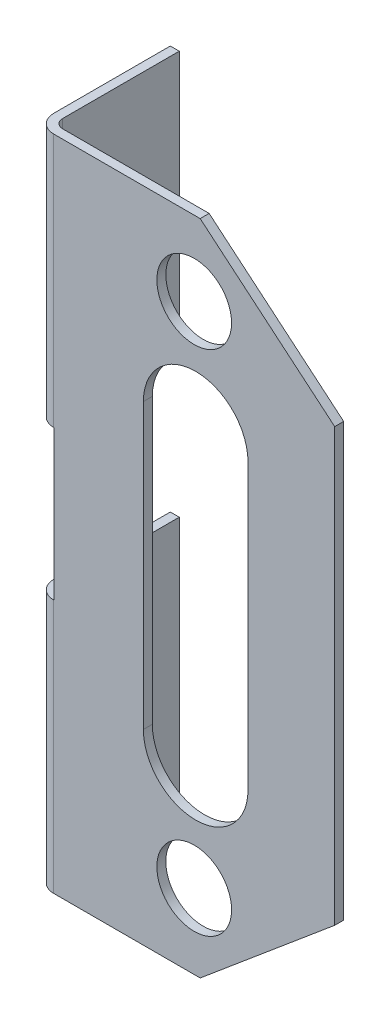
ISO-10303-21;
HEADER;
FILE_DESCRIPTION(('STEP AP214'),'2;1');
FILE_NAME('part.step','',(''),(''),'','','');
FILE_SCHEMA(('AUTOMOTIVE_DESIGN { 1 0 10303 214 1 1 1 1 }'));
ENDSEC;
DATA;
#1=APPLICATION_CONTEXT('core data for automotive mechanical design processes');
#2=APPLICATION_PROTOCOL_DEFINITION('international standard','automotive_design',2000,#1);
#3=PRODUCT_CONTEXT('',#1,'mechanical');
#4=PRODUCT('Part','Part','',(#3));
#5=PRODUCT_RELATED_PRODUCT_CATEGORY('part','',(#4));
#6=PRODUCT_DEFINITION_FORMATION('','',#4);
#7=PRODUCT_DEFINITION_CONTEXT('part definition',#1,'design');
#8=PRODUCT_DEFINITION('design','',#6,#7);
#9=PRODUCT_DEFINITION_SHAPE('','',#8);
#10=(LENGTH_UNIT() NAMED_UNIT(*) SI_UNIT(.MILLI.,.METRE.));
#11=(NAMED_UNIT(*) PLANE_ANGLE_UNIT() SI_UNIT($,.RADIAN.));
#12=(NAMED_UNIT(*) SI_UNIT($,.STERADIAN.) SOLID_ANGLE_UNIT());
#13=UNCERTAINTY_MEASURE_WITH_UNIT(LENGTH_MEASURE(1.E-05),#10,'distance_accuracy_value','');
#14=(GEOMETRIC_REPRESENTATION_CONTEXT(3) GLOBAL_UNCERTAINTY_ASSIGNED_CONTEXT((#13)) GLOBAL_UNIT_ASSIGNED_CONTEXT((#10,
#11,#12)) REPRESENTATION_CONTEXT('',''));
#15=CARTESIAN_POINT('',(0.,0.,0.));
#16=DIRECTION('',(0.,0.,1.));
#17=DIRECTION('',(1.,0.,0.));
#18=AXIS2_PLACEMENT_3D('',#15,#16,#17);
#19=CARTESIAN_POINT('',(-17.1278685868031,-12.6536882964313,-4.2));
#20=DIRECTION('',(0.,0.,-1.));
#21=DIRECTION('',(-1.,0.,0.));
#22=AXIS2_PLACEMENT_3D('',#19,#20,#21);
#23=PLANE('',#22);
#24=DIRECTION('',(0.,1.,0.));
#25=VECTOR('',#24,1.);
#26=CARTESIAN_POINT('',(-17.1278685868031,-8.4036882964313,-4.2));
#27=LINE('',#26,#25);
#28=CARTESIAN_POINT('',(-17.1278685868031,-12.6536882964313,-4.2));
#29=VERTEX_POINT('',#28);
#30=CARTESIAN_POINT('',(-17.1278685868031,-4.1536882964313,-4.2));
#31=VERTEX_POINT('',#30);
#32=EDGE_CURVE('E156',#29,#31,#27,.T.);
#33=ORIENTED_EDGE('',*,*,#32,.F.);
#34=DIRECTION('',(-1.,0.,0.));
#35=VECTOR('',#34,1.);
#36=CARTESIAN_POINT('',(-17.1278685868031,-12.6536882964313,-4.2));
#37=LINE('',#36,#35);
#38=CARTESIAN_POINT('',(-17.4278685868031,-12.6536882964313,-4.2));
#39=VERTEX_POINT('',#38);
#40=EDGE_CURVE('E212',#29,#39,#37,.T.);
#41=ORIENTED_EDGE('',*,*,#40,.T.);
#42=DIRECTION('',(0.,1.,0.));
#43=VECTOR('',#42,1.);
#44=CARTESIAN_POINT('',(-17.4278685868031,-8.4036882964313,-4.2));
#45=LINE('',#44,#43);
#46=CARTESIAN_POINT('',(-17.4278685868031,-4.1536882964313,-4.2));
#47=VERTEX_POINT('',#46);
#48=EDGE_CURVE('E138',#39,#47,#45,.T.);
#49=ORIENTED_EDGE('',*,*,#48,.T.);
#50=DIRECTION('',(1.,0.,0.));
#51=VECTOR('',#50,1.);
#52=CARTESIAN_POINT('',(-17.1278685868031,-4.1536882964313,-4.2));
#53=LINE('',#52,#51);
#54=EDGE_CURVE('E128',#31,#47,#53,.F.);
#55=ORIENTED_EDGE('',*,*,#54,.F.);
#56=EDGE_LOOP('',(#33,#41,#49,#55));
#57=FACE_BOUND('',#56,.T.);
#58=ADVANCED_FACE('F16',(#57),#23,.T.);
#59=CARTESIAN_POINT('',(-17.1278685868031,-4.1536882964313,-4.2));
#60=DIRECTION('',(0.,1.,0.));
#61=DIRECTION('',(0.,0.,1.));
#62=AXIS2_PLACEMENT_3D('',#59,#60,#61);
#63=PLANE('',#62);
#64=DIRECTION('',(1.,0.,0.));
#65=VECTOR('',#64,1.);
#66=CARTESIAN_POINT('',(-17.1278685868031,-4.1536882964313,0.));
#67=LINE('',#66,#65);
#68=CARTESIAN_POINT('',(-16.8178685868031,-4.1536882964313,0.));
#69=VERTEX_POINT('',#68);
#70=CARTESIAN_POINT('',(-16.8278685868031,-4.1536882964313,0.));
#71=VERTEX_POINT('',#70);
#72=EDGE_CURVE('E190',#69,#71,#67,.F.);
#73=ORIENTED_EDGE('',*,*,#72,.T.);
#74=CARTESIAN_POINT('',(-16.8278685868031,-4.1536882964313,-0.3));
#75=DIRECTION('',(0.,-1.,0.));
#76=DIRECTION('',(1.,0.,0.));
#77=AXIS2_PLACEMENT_3D('',#74,#75,#76);
#78=CIRCLE('',#77,0.3);
#79=CARTESIAN_POINT('',(-17.1278685868031,-4.1536882964313,-0.3));
#80=VERTEX_POINT('',#79);
#81=EDGE_CURVE('E273',#80,#71,#78,.F.);
#82=ORIENTED_EDGE('',*,*,#81,.F.);
#83=DIRECTION('',(0.,0.,-1.));
#84=VECTOR('',#83,1.);
#85=CARTESIAN_POINT('',(-17.1278685868031,-4.1536882964313,-1.95));
#86=LINE('',#85,#84);
#87=EDGE_CURVE('E159',#31,#80,#86,.F.);
#88=ORIENTED_EDGE('',*,*,#87,.F.);
#89=ORIENTED_EDGE('',*,*,#54,.T.);
#90=DIRECTION('',(0.,0.,-1.));
#91=VECTOR('',#90,1.);
#92=CARTESIAN_POINT('',(-17.4278685868031,-4.1536882964313,-1.95));
#93=LINE('',#92,#91);
#94=CARTESIAN_POINT('',(-17.4278685868031,-4.1536882964313,-0.3));
#95=VERTEX_POINT('',#94);
#96=EDGE_CURVE('E131',#47,#95,#93,.F.);
#97=ORIENTED_EDGE('',*,*,#96,.T.);
#98=CARTESIAN_POINT('',(-16.8278685868031,-4.1536882964313,-0.3));
#99=DIRECTION('',(0.,-1.,0.));
#100=DIRECTION('',(1.,0.,0.));
#101=AXIS2_PLACEMENT_3D('',#98,#99,#100);
#102=CIRCLE('',#101,0.6);
#103=CARTESIAN_POINT('',(-16.8278685868031,-4.1536882964313,0.3));
#104=VERTEX_POINT('',#103);
#105=EDGE_CURVE('E19',#95,#104,#102,.F.);
#106=ORIENTED_EDGE('',*,*,#105,.T.);
#107=DIRECTION('',(1.,0.,0.));
#108=VECTOR('',#107,1.);
#109=CARTESIAN_POINT('',(-17.1278685868031,-4.1536882964313,0.3));
#110=LINE('',#109,#108);
#111=CARTESIAN_POINT('',(-16.8178685868031,-4.1536882964313,0.3));
#112=VERTEX_POINT('',#111);
#113=EDGE_CURVE('E127',#104,#112,#110,.T.);
#114=ORIENTED_EDGE('',*,*,#113,.T.);
#115=DIRECTION('',(0.,0.,1.));
#116=VECTOR('',#115,1.);
#117=CARTESIAN_POINT('',(-16.8178685868031,-4.1536882964313,-4.2));
#118=LINE('',#117,#116);
#119=EDGE_CURVE('E201',#112,#69,#118,.F.);
#120=ORIENTED_EDGE('',*,*,#119,.T.);
#121=EDGE_LOOP('',(#73,#82,#88,#89,#97,#106,#114,#120));
#122=FACE_BOUND('',#121,.T.);
#123=ADVANCED_FACE('F132',(#122),#63,.T.);
#124=CARTESIAN_POINT('',(-17.1278685868031,0.846311703568698,0.3));
#125=DIRECTION('',(0.,-1.,0.));
#126=DIRECTION('',(1.,0.,0.));
#127=AXIS2_PLACEMENT_3D('',#124,#125,#126);
#128=PLANE('',#127);
#129=DIRECTION('',(1.,0.,0.));
#130=VECTOR('',#129,1.);
#131=CARTESIAN_POINT('',(-17.1278685868031,0.846311703568698,0.3));
#132=LINE('',#131,#130);
#133=CARTESIAN_POINT('',(-16.8178685868031,0.846311703568698,0.3));
#134=VERTEX_POINT('',#133);
#135=CARTESIAN_POINT('',(-16.8278685868031,0.846311703568698,0.3));
#136=VERTEX_POINT('',#135);
#137=EDGE_CURVE('E181',#134,#136,#132,.F.);
#138=ORIENTED_EDGE('',*,*,#137,.T.);
#139=CARTESIAN_POINT('',(-16.8278685868031,0.846311703568698,-0.3));
#140=DIRECTION('',(0.,-1.,0.));
#141=DIRECTION('',(1.,0.,0.));
#142=AXIS2_PLACEMENT_3D('',#139,#140,#141);
#143=CIRCLE('',#142,0.6);
#144=CARTESIAN_POINT('',(-17.4278685868031,0.846311703568698,-0.3));
#145=VERTEX_POINT('',#144);
#146=EDGE_CURVE('E173',#136,#145,#143,.T.);
#147=ORIENTED_EDGE('',*,*,#146,.T.);
#148=DIRECTION('',(0.,0.,-1.));
#149=VECTOR('',#148,1.);
#150=CARTESIAN_POINT('',(-17.4278685868031,0.846311703568698,-1.95));
#151=LINE('',#150,#149);
#152=CARTESIAN_POINT('',(-17.4278685868031,0.846311703568698,-4.2));
#153=VERTEX_POINT('',#152);
#154=EDGE_CURVE('E283',#145,#153,#151,.T.);
#155=ORIENTED_EDGE('',*,*,#154,.T.);
#156=DIRECTION('',(-1.,0.,0.));
#157=VECTOR('',#156,1.);
#158=CARTESIAN_POINT('',(-17.1278685868031,0.846311703568697,-4.2));
#159=LINE('',#158,#157);
#160=CARTESIAN_POINT('',(-17.1278685868031,0.846311703568698,-4.2));
#161=VERTEX_POINT('',#160);
#162=EDGE_CURVE('E172',#161,#153,#159,.T.);
#163=ORIENTED_EDGE('',*,*,#162,.F.);
#164=DIRECTION('',(0.,0.,-1.));
#165=VECTOR('',#164,1.);
#166=CARTESIAN_POINT('',(-17.1278685868031,0.846311703568698,-1.95));
#167=LINE('',#166,#165);
#168=CARTESIAN_POINT('',(-17.1278685868031,0.846311703568698,-0.3));
#169=VERTEX_POINT('',#168);
#170=EDGE_CURVE('E193',#169,#161,#167,.T.);
#171=ORIENTED_EDGE('',*,*,#170,.F.);
#172=CARTESIAN_POINT('',(-16.8278685868031,0.846311703568699,-0.3));
#173=DIRECTION('',(0.,-1.,0.));
#174=DIRECTION('',(1.,0.,0.));
#175=AXIS2_PLACEMENT_3D('',#172,#173,#174);
#176=CIRCLE('',#175,0.3);
#177=CARTESIAN_POINT('',(-16.8278685868031,0.846311703568698,0.));
#178=VERTEX_POINT('',#177);
#179=EDGE_CURVE('E276',#178,#169,#176,.T.);
#180=ORIENTED_EDGE('',*,*,#179,.F.);
#181=DIRECTION('',(1.,0.,0.));
#182=VECTOR('',#181,1.);
#183=CARTESIAN_POINT('',(-17.1278685868031,0.846311703568698,0.));
#184=LINE('',#183,#182);
#185=CARTESIAN_POINT('',(-16.8178685868031,0.846311703568698,0.));
#186=VERTEX_POINT('',#185);
#187=EDGE_CURVE('E187',#178,#186,#184,.T.);
#188=ORIENTED_EDGE('',*,*,#187,.T.);
#189=DIRECTION('',(0.,0.,1.));
#190=VECTOR('',#189,1.);
#191=CARTESIAN_POINT('',(-16.8178685868031,0.846311703568698,0.3));
#192=LINE('',#191,#190);
#193=EDGE_CURVE('E184',#186,#134,#192,.T.);
#194=ORIENTED_EDGE('',*,*,#193,.T.);
#195=EDGE_LOOP('',(#138,#147,#155,#163,#171,#180,#188,#194));
#196=FACE_BOUND('',#195,.T.);
#197=ADVANCED_FACE('F281',(#196),#128,.T.);
#198=CARTESIAN_POINT('',(-17.1278685868031,0.846311703568697,-4.2));
#199=DIRECTION('',(0.,0.,-1.));
#200=DIRECTION('',(-1.,0.,0.));
#201=AXIS2_PLACEMENT_3D('',#198,#199,#200);
#202=PLANE('',#201);
#203=DIRECTION('',(0.,1.,0.));
#204=VECTOR('',#203,1.);
#205=CARTESIAN_POINT('',(-17.1278685868031,5.0963117035687,-4.2));
#206=LINE('',#205,#204);
#207=CARTESIAN_POINT('',(-17.1278685868031,9.3463117035687,-4.2));
#208=VERTEX_POINT('',#207);
#209=EDGE_CURVE('E196',#161,#208,#206,.T.);
#210=ORIENTED_EDGE('',*,*,#209,.F.);
#211=ORIENTED_EDGE('',*,*,#162,.T.);
#212=DIRECTION('',(0.,1.,0.));
#213=VECTOR('',#212,1.);
#214=CARTESIAN_POINT('',(-17.4278685868031,5.0963117035687,-4.2));
#215=LINE('',#214,#213);
#216=CARTESIAN_POINT('',(-17.4278685868031,9.3463117035687,-4.2));
#217=VERTEX_POINT('',#216);
#218=EDGE_CURVE('E295',#153,#217,#215,.T.);
#219=ORIENTED_EDGE('',*,*,#218,.T.);
#220=DIRECTION('',(-1.,0.,0.));
#221=VECTOR('',#220,1.);
#222=CARTESIAN_POINT('',(-17.1278685868031,9.3463117035687,-4.2));
#223=LINE('',#222,#221);
#224=EDGE_CURVE('E169',#217,#208,#223,.F.);
#225=ORIENTED_EDGE('',*,*,#224,.T.);
#226=EDGE_LOOP('',(#210,#211,#219,#225));
#227=FACE_BOUND('',#226,.T.);
#228=ADVANCED_FACE('F489',(#227),#202,.T.);
#229=CARTESIAN_POINT('',(-16.8278685868031,9.3463117035687,-0.3));
#230=DIRECTION('',(0.,-1.,0.));
#231=DIRECTION('',(1.,0.,0.));
#232=AXIS2_PLACEMENT_3D('',#229,#230,#231);
#233=CYLINDRICAL_SURFACE('',#232,0.3);
#234=DIRECTION('',(0.,1.,0.));
#235=VECTOR('',#234,1.);
#236=CARTESIAN_POINT('',(-16.8278685868031,-1.6536882964313,0.));
#237=LINE('',#236,#235);
#238=CARTESIAN_POINT('',(-16.8278685868031,9.3463117035687,0.));
#239=VERTEX_POINT('',#238);
#240=EDGE_CURVE('E148',#239,#178,#237,.F.);
#241=ORIENTED_EDGE('',*,*,#240,.T.);
#242=ORIENTED_EDGE('',*,*,#179,.T.);
#243=DIRECTION('',(0.,1.,0.));
#244=VECTOR('',#243,1.);
#245=CARTESIAN_POINT('',(-17.1278685868031,5.0963117035687,-0.3));
#246=LINE('',#245,#244);
#247=CARTESIAN_POINT('',(-17.1278685868031,9.3463117035687,-0.3));
#248=VERTEX_POINT('',#247);
#249=EDGE_CURVE('E197',#248,#169,#246,.F.);
#250=ORIENTED_EDGE('',*,*,#249,.F.);
#251=CARTESIAN_POINT('',(-16.8278685868031,9.3463117035687,-0.3));
#252=DIRECTION('',(0.,-1.,0.));
#253=DIRECTION('',(1.,0.,0.));
#254=AXIS2_PLACEMENT_3D('',#251,#252,#253);
#255=CIRCLE('',#254,0.3);
#256=EDGE_CURVE('E178',#248,#239,#255,.F.);
#257=ORIENTED_EDGE('',*,*,#256,.T.);
#258=EDGE_LOOP('',(#241,#242,#250,#257));
#259=FACE_BOUND('',#258,.T.);
#260=ADVANCED_FACE('F483',(#259),#233,.F.);
#261=CARTESIAN_POINT('',(-16.8278685868031,-4.1536882964313,-0.3));
#262=DIRECTION('',(0.,-1.,0.));
#263=DIRECTION('',(1.,0.,0.));
#264=AXIS2_PLACEMENT_3D('',#261,#262,#263);
#265=CYLINDRICAL_SURFACE('',#264,0.3);
#266=DIRECTION('',(0.,1.,0.));
#267=VECTOR('',#266,1.);
#268=CARTESIAN_POINT('',(-16.8278685868031,-1.6536882964313,0.));
#269=LINE('',#268,#267);
#270=CARTESIAN_POINT('',(-16.8278685868031,-12.6536882964313,0.));
#271=VERTEX_POINT('',#270);
#272=EDGE_CURVE('E143',#71,#271,#269,.F.);
#273=ORIENTED_EDGE('',*,*,#272,.T.);
#274=CARTESIAN_POINT('',(-16.8278685868031,-12.6536882964313,-0.3));
#275=DIRECTION('',(0.,-1.,0.));
#276=DIRECTION('',(1.,0.,0.));
#277=AXIS2_PLACEMENT_3D('',#274,#275,#276);
#278=CIRCLE('',#277,0.3);
#279=CARTESIAN_POINT('',(-17.1278685868031,-12.6536882964313,-0.3));
#280=VERTEX_POINT('',#279);
#281=EDGE_CURVE('E164',#271,#280,#278,.T.);
#282=ORIENTED_EDGE('',*,*,#281,.T.);
#283=DIRECTION('',(0.,1.,0.));
#284=VECTOR('',#283,1.);
#285=CARTESIAN_POINT('',(-17.1278685868031,-8.4036882964313,-0.3));
#286=LINE('',#285,#284);
#287=EDGE_CURVE('E137',#80,#280,#286,.F.);
#288=ORIENTED_EDGE('',*,*,#287,.F.);
#289=ORIENTED_EDGE('',*,*,#81,.T.);
#290=EDGE_LOOP('',(#273,#282,#288,#289));
#291=FACE_BOUND('',#290,.T.);
#292=ADVANCED_FACE('F451',(#291),#265,.F.);
#293=CARTESIAN_POINT('',(-17.4278685868031,-8.4036882964313,-1.95));
#294=DIRECTION('',(1.,0.,0.));
#295=DIRECTION('',(0.,0.,-1.));
#296=AXIS2_PLACEMENT_3D('',#293,#294,#295);
#297=PLANE('',#296);
#298=ORIENTED_EDGE('',*,*,#96,.F.);
#299=ORIENTED_EDGE('',*,*,#48,.F.);
#300=DIRECTION('',(0.,0.,-1.));
#301=VECTOR('',#300,1.);
#302=CARTESIAN_POINT('',(-17.4278685868031,-12.6536882964313,0.3));
#303=LINE('',#302,#301);
#304=CARTESIAN_POINT('',(-17.4278685868031,-12.6536882964313,-0.3));
#305=VERTEX_POINT('',#304);
#306=EDGE_CURVE('E142',#305,#39,#303,.T.);
#307=ORIENTED_EDGE('',*,*,#306,.F.);
#308=DIRECTION('',(0.,-1.,0.));
#309=VECTOR('',#308,1.);
#310=CARTESIAN_POINT('',(-17.4278685868031,-8.4036882964313,-0.3));
#311=LINE('',#310,#309);
#312=EDGE_CURVE('E121',#95,#305,#311,.T.);
#313=ORIENTED_EDGE('',*,*,#312,.F.);
#314=EDGE_LOOP('',(#298,#299,#307,#313));
#315=FACE_BOUND('',#314,.T.);
#316=ADVANCED_FACE('F140',(#315),#297,.F.);
#317=CARTESIAN_POINT('',(-17.1278685868031,-8.4036882964313,-1.95));
#318=DIRECTION('',(1.,0.,0.));
#319=DIRECTION('',(0.,0.,-1.));
#320=AXIS2_PLACEMENT_3D('',#317,#318,#319);
#321=PLANE('',#320);
#322=ORIENTED_EDGE('',*,*,#32,.T.);
#323=ORIENTED_EDGE('',*,*,#87,.T.);
#324=ORIENTED_EDGE('',*,*,#287,.T.);
#325=DIRECTION('',(0.,0.,-1.));
#326=VECTOR('',#325,1.);
#327=CARTESIAN_POINT('',(-17.1278685868031,-12.6536882964313,0.3));
#328=LINE('',#327,#326);
#329=EDGE_CURVE('E145',#29,#280,#328,.F.);
#330=ORIENTED_EDGE('',*,*,#329,.F.);
#331=EDGE_LOOP('',(#322,#323,#324,#330));
#332=FACE_BOUND('',#331,.T.);
#333=ADVANCED_FACE('F448',(#332),#321,.T.);
#334=CARTESIAN_POINT('',(-17.1278685868031,5.0963117035687,-1.95));
#335=DIRECTION('',(1.,0.,0.));
#336=DIRECTION('',(0.,0.,-1.));
#337=AXIS2_PLACEMENT_3D('',#334,#335,#336);
#338=PLANE('',#337);
#339=ORIENTED_EDGE('',*,*,#209,.T.);
#340=DIRECTION('',(0.,0.,1.));
#341=VECTOR('',#340,1.);
#342=CARTESIAN_POINT('',(-17.1278685868031,9.3463117035687,-4.2));
#343=LINE('',#342,#341);
#344=EDGE_CURVE('E314',#248,#208,#343,.F.);
#345=ORIENTED_EDGE('',*,*,#344,.F.);
#346=ORIENTED_EDGE('',*,*,#249,.T.);
#347=ORIENTED_EDGE('',*,*,#170,.T.);
#348=EDGE_LOOP('',(#339,#345,#346,#347));
#349=FACE_BOUND('',#348,.T.);
#350=ADVANCED_FACE('F486',(#349),#338,.T.);
#351=CARTESIAN_POINT('',(-17.4278685868031,5.0963117035687,-1.95));
#352=DIRECTION('',(1.,0.,0.));
#353=DIRECTION('',(0.,0.,-1.));
#354=AXIS2_PLACEMENT_3D('',#351,#352,#353);
#355=PLANE('',#354);
#356=DIRECTION('',(0.,0.,1.));
#357=VECTOR('',#356,1.);
#358=CARTESIAN_POINT('',(-17.4278685868031,9.3463117035687,-4.2));
#359=LINE('',#358,#357);
#360=CARTESIAN_POINT('',(-17.4278685868031,9.3463117035687,-0.3));
#361=VERTEX_POINT('',#360);
#362=EDGE_CURVE('E378',#217,#361,#359,.T.);
#363=ORIENTED_EDGE('',*,*,#362,.F.);
#364=ORIENTED_EDGE('',*,*,#218,.F.);
#365=ORIENTED_EDGE('',*,*,#154,.F.);
#366=DIRECTION('',(0.,-1.,0.));
#367=VECTOR('',#366,1.);
#368=CARTESIAN_POINT('',(-17.4278685868031,5.0963117035687,-0.3));
#369=LINE('',#368,#367);
#370=EDGE_CURVE('E267',#361,#145,#369,.T.);
#371=ORIENTED_EDGE('',*,*,#370,.F.);
#372=EDGE_LOOP('',(#363,#364,#365,#371));
#373=FACE_BOUND('',#372,.T.);
#374=ADVANCED_FACE('F292',(#373),#355,.F.);
#375=CARTESIAN_POINT('',(-12.7986850530039,-1.6536882964313,0.));
#376=DIRECTION('',(0.,0.,1.));
#377=DIRECTION('',(1.,0.,0.));
#378=AXIS2_PLACEMENT_3D('',#375,#376,#377);
#379=PLANE('',#378);
#380=ORIENTED_EDGE('',*,*,#72,.F.);
#381=DIRECTION('',(0.,-1.,0.));
#382=VECTOR('',#381,1.);
#383=CARTESIAN_POINT('',(-16.8178685868031,-4.1536882964313,0.));
#384=LINE('',#383,#382);
#385=EDGE_CURVE('E230',#186,#69,#384,.T.);
#386=ORIENTED_EDGE('',*,*,#385,.F.);
#387=ORIENTED_EDGE('',*,*,#187,.F.);
#388=ORIENTED_EDGE('',*,*,#240,.F.);
#389=DIRECTION('',(1.,0.,0.));
#390=VECTOR('',#389,1.);
#391=CARTESIAN_POINT('',(-17.1278685868031,9.3463117035687,0.));
#392=LINE('',#391,#390);
#393=CARTESIAN_POINT('',(-11.9278685868031,9.3463117035687,0.));
#394=VERTEX_POINT('',#393);
#395=EDGE_CURVE('E298',#394,#239,#392,.F.);
#396=ORIENTED_EDGE('',*,*,#395,.F.);
#397=DIRECTION('',(-0.766044443118978,0.642787609686539,0.));
#398=VECTOR('',#397,1.);
#399=CARTESIAN_POINT('',(-11.9278685868031,9.3463117035687,0.));
#400=LINE('',#399,#398);
#401=CARTESIAN_POINT('',(-7.42786858680307,5.57036336327094,0.));
#402=VERTEX_POINT('',#401);
#403=EDGE_CURVE('E311',#402,#394,#400,.T.);
#404=ORIENTED_EDGE('',*,*,#403,.F.);
#405=DIRECTION('',(0.,1.,0.));
#406=VECTOR('',#405,1.);
#407=CARTESIAN_POINT('',(-7.42786858680307,5.57036336327094,0.));
#408=LINE('',#407,#406);
#409=CARTESIAN_POINT('',(-7.42786858680307,-8.87773995613354,0.));
#410=VERTEX_POINT('',#409);
#411=EDGE_CURVE('E327',#410,#402,#408,.T.);
#412=ORIENTED_EDGE('',*,*,#411,.F.);
#413=DIRECTION('',(0.766044443118978,0.64278760968654,0.));
#414=VECTOR('',#413,1.);
#415=CARTESIAN_POINT('',(-7.42786858680307,-8.87773995613354,0.));
#416=LINE('',#415,#414);
#417=CARTESIAN_POINT('',(-11.9278685868031,-12.6536882964313,0.));
#418=VERTEX_POINT('',#417);
#419=EDGE_CURVE('E332',#418,#410,#416,.T.);
#420=ORIENTED_EDGE('',*,*,#419,.F.);
#421=DIRECTION('',(1.,0.,0.));
#422=VECTOR('',#421,1.);
#423=CARTESIAN_POINT('',(-17.1278685868031,-12.6536882964313,0.));
#424=LINE('',#423,#422);
#425=EDGE_CURVE('E271',#271,#418,#424,.T.);
#426=ORIENTED_EDGE('',*,*,#425,.F.);
#427=ORIENTED_EDGE('',*,*,#272,.F.);
#428=EDGE_LOOP('',(#380,#386,#387,#388,#396,#404,#412,#420,#426,#427));
#429=FACE_BOUND('',#428,.T.);
#430=CARTESIAN_POINT('',(-12.1278685868031,6.8463117035687,0.));
#431=DIRECTION('',(0.,0.,1.));
#432=DIRECTION('',(1.,0.,0.));
#433=AXIS2_PLACEMENT_3D('',#430,#431,#432);
#434=CIRCLE('',#433,1.25);
#435=CARTESIAN_POINT('',(-10.8778685868031,6.8463117035687,0.));
#436=VERTEX_POINT('',#435);
#437=EDGE_CURVE('E250',#436,#436,#434,.T.);
#438=ORIENTED_EDGE('',*,*,#437,.T.);
#439=EDGE_LOOP('',(#438));
#440=FACE_BOUND('',#439,.T.);
#441=CARTESIAN_POINT('',(-12.1278685868031,-10.1536882964313,0.));
#442=DIRECTION('',(0.,0.,1.));
#443=DIRECTION('',(1.,0.,0.));
#444=AXIS2_PLACEMENT_3D('',#441,#442,#443);
#445=CIRCLE('',#444,1.25);
#446=CARTESIAN_POINT('',(-10.8778685868031,-10.1536882964313,0.));
#447=VERTEX_POINT('',#446);
#448=EDGE_CURVE('E253',#447,#447,#445,.T.);
#449=ORIENTED_EDGE('',*,*,#448,.T.);
#450=EDGE_LOOP('',(#449));
#451=FACE_BOUND('',#450,.T.);
#452=CARTESIAN_POINT('',(-12.0778685868031,-6.4036882964313,0.));
#453=DIRECTION('',(0.,0.,-1.));
#454=DIRECTION('',(-1.,0.,0.));
#455=AXIS2_PLACEMENT_3D('',#452,#453,#454);
#456=CIRCLE('',#455,1.75);
#457=CARTESIAN_POINT('',(-13.8278685868031,-6.4036882964313,0.));
#458=VERTEX_POINT('',#457);
#459=CARTESIAN_POINT('',(-10.3278685868031,-6.4036882964313,0.));
#460=VERTEX_POINT('',#459);
#461=EDGE_CURVE('E256',#458,#460,#456,.F.);
#462=ORIENTED_EDGE('',*,*,#461,.T.);
#463=DIRECTION('',(0.,1.,0.));
#464=VECTOR('',#463,1.);
#465=CARTESIAN_POINT('',(-10.3278685868031,-6.4036882964313,0.));
#466=LINE('',#465,#464);
#467=CARTESIAN_POINT('',(-10.3278685868031,3.0963117035687,0.));
#468=VERTEX_POINT('',#467);
#469=EDGE_CURVE('E304',#460,#468,#466,.T.);
#470=ORIENTED_EDGE('',*,*,#469,.T.);
#471=CARTESIAN_POINT('',(-12.0778685868031,3.0963117035687,0.));
#472=DIRECTION('',(0.,0.,-1.));
#473=DIRECTION('',(-1.,0.,0.));
#474=AXIS2_PLACEMENT_3D('',#471,#472,#473);
#475=CIRCLE('',#474,1.75);
#476=CARTESIAN_POINT('',(-13.8278685868031,3.0963117035687,0.));
#477=VERTEX_POINT('',#476);
#478=EDGE_CURVE('E260',#468,#477,#475,.F.);
#479=ORIENTED_EDGE('',*,*,#478,.T.);
#480=DIRECTION('',(0.,-1.,0.));
#481=VECTOR('',#480,1.);
#482=CARTESIAN_POINT('',(-13.8278685868031,3.0963117035687,0.));
#483=LINE('',#482,#481);
#484=EDGE_CURVE('E233',#477,#458,#483,.T.);
#485=ORIENTED_EDGE('',*,*,#484,.T.);
#486=EDGE_LOOP('',(#462,#470,#479,#485));
#487=FACE_BOUND('',#486,.T.);
#488=ADVANCED_FACE('F455',(#429,#440,#451,#487),#379,.F.);
#489=CARTESIAN_POINT('',(-16.8278685868031,-8.4036882964313,-0.3));
#490=DIRECTION('',(0.,-1.,0.));
#491=DIRECTION('',(1.,0.,0.));
#492=AXIS2_PLACEMENT_3D('',#489,#490,#491);
#493=CYLINDRICAL_SURFACE('',#492,0.6);
#494=DIRECTION('',(0.,1.,0.));
#495=VECTOR('',#494,1.);
#496=CARTESIAN_POINT('',(-16.8278685868031,-1.6536882964313,0.3));
#497=LINE('',#496,#495);
#498=CARTESIAN_POINT('',(-16.8278685868031,-12.6536882964313,0.3));
#499=VERTEX_POINT('',#498);
#500=EDGE_CURVE('E124',#104,#499,#497,.F.);
#501=ORIENTED_EDGE('',*,*,#500,.F.);
#502=ORIENTED_EDGE('',*,*,#105,.F.);
#503=ORIENTED_EDGE('',*,*,#312,.T.);
#504=CARTESIAN_POINT('',(-16.8278685868031,-12.6536882964313,-0.3));
#505=DIRECTION('',(0.,-1.,0.));
#506=DIRECTION('',(1.,0.,0.));
#507=AXIS2_PLACEMENT_3D('',#504,#505,#506);
#508=CIRCLE('',#507,0.6);
#509=EDGE_CURVE('E268',#499,#305,#508,.T.);
#510=ORIENTED_EDGE('',*,*,#509,.F.);
#511=EDGE_LOOP('',(#501,#502,#503,#510));
#512=FACE_BOUND('',#511,.T.);
#513=ADVANCED_FACE('F119',(#512),#493,.T.);
#514=CARTESIAN_POINT('',(-17.1278685868031,-12.6536882964313,0.3));
#515=DIRECTION('',(0.,-1.,0.));
#516=DIRECTION('',(0.,0.,-1.));
#517=AXIS2_PLACEMENT_3D('',#514,#515,#516);
#518=PLANE('',#517);
#519=DIRECTION('',(1.,0.,0.));
#520=VECTOR('',#519,1.);
#521=CARTESIAN_POINT('',(-12.7986850530039,-12.6536882964313,0.3));
#522=LINE('',#521,#520);
#523=CARTESIAN_POINT('',(-11.9278685868031,-12.6536882964313,0.3));
#524=VERTEX_POINT('',#523);
#525=EDGE_CURVE('E351',#499,#524,#522,.T.);
#526=ORIENTED_EDGE('',*,*,#525,.F.);
#527=ORIENTED_EDGE('',*,*,#509,.T.);
#528=ORIENTED_EDGE('',*,*,#306,.T.);
#529=ORIENTED_EDGE('',*,*,#40,.F.);
#530=ORIENTED_EDGE('',*,*,#329,.T.);
#531=ORIENTED_EDGE('',*,*,#281,.F.);
#532=ORIENTED_EDGE('',*,*,#425,.T.);
#533=DIRECTION('',(0.,0.,1.));
#534=VECTOR('',#533,1.);
#535=CARTESIAN_POINT('',(-11.9278685868031,-12.6536882964313,0.));
#536=LINE('',#535,#534);
#537=EDGE_CURVE('E270',#524,#418,#536,.F.);
#538=ORIENTED_EDGE('',*,*,#537,.F.);
#539=EDGE_LOOP('',(#526,#527,#528,#529,#530,#531,#532,#538));
#540=FACE_BOUND('',#539,.T.);
#541=ADVANCED_FACE('F445',(#540),#518,.T.);
#542=CARTESIAN_POINT('',(-7.42786858680307,-8.87773995613354,0.));
#543=DIRECTION('',(0.64278760968654,-0.766044443118978,0.));
#544=DIRECTION('',(0.766044443118978,0.64278760968654,0.));
#545=AXIS2_PLACEMENT_3D('',#542,#543,#544);
#546=PLANE('',#545);
#547=ORIENTED_EDGE('',*,*,#419,.T.);
#548=DIRECTION('',(0.,0.,-1.));
#549=VECTOR('',#548,1.);
#550=CARTESIAN_POINT('',(-7.42786858680307,-8.87773995613354,0.));
#551=LINE('',#550,#549);
#552=CARTESIAN_POINT('',(-7.42786858680307,-8.87773995613354,0.3));
#553=VERTEX_POINT('',#552);
#554=EDGE_CURVE('E330',#553,#410,#551,.T.);
#555=ORIENTED_EDGE('',*,*,#554,.F.);
#556=DIRECTION('',(0.766044443118978,0.64278760968654,0.));
#557=VECTOR('',#556,1.);
#558=CARTESIAN_POINT('',(-11.9278685868031,-12.6536882964313,0.3));
#559=LINE('',#558,#557);
#560=EDGE_CURVE('E354',#524,#553,#559,.T.);
#561=ORIENTED_EDGE('',*,*,#560,.F.);
#562=ORIENTED_EDGE('',*,*,#537,.T.);
#563=EDGE_LOOP('',(#547,#555,#561,#562));
#564=FACE_BOUND('',#563,.T.);
#565=ADVANCED_FACE('F419',(#564),#546,.T.);
#566=CARTESIAN_POINT('',(-7.42786858680307,5.57036336327094,0.));
#567=DIRECTION('',(1.,0.,0.));
#568=DIRECTION('',(0.,0.,-1.));
#569=AXIS2_PLACEMENT_3D('',#566,#567,#568);
#570=PLANE('',#569);
#571=ORIENTED_EDGE('',*,*,#411,.T.);
#572=DIRECTION('',(0.,0.,1.));
#573=VECTOR('',#572,1.);
#574=CARTESIAN_POINT('',(-7.42786858680307,5.57036336327094,0.));
#575=LINE('',#574,#573);
#576=CARTESIAN_POINT('',(-7.42786858680307,5.57036336327094,0.3));
#577=VERTEX_POINT('',#576);
#578=EDGE_CURVE('E315',#577,#402,#575,.F.);
#579=ORIENTED_EDGE('',*,*,#578,.F.);
#580=DIRECTION('',(0.,1.,0.));
#581=VECTOR('',#580,1.);
#582=CARTESIAN_POINT('',(-7.42786858680307,-1.6536882964313,0.3));
#583=LINE('',#582,#581);
#584=EDGE_CURVE('E399',#553,#577,#583,.T.);
#585=ORIENTED_EDGE('',*,*,#584,.F.);
#586=ORIENTED_EDGE('',*,*,#554,.T.);
#587=EDGE_LOOP('',(#571,#579,#585,#586));
#588=FACE_BOUND('',#587,.T.);
#589=ADVANCED_FACE('F461',(#588),#570,.T.);
#590=CARTESIAN_POINT('',(-11.9278685868031,9.3463117035687,0.));
#591=DIRECTION('',(0.642787609686539,0.766044443118978,0.));
#592=DIRECTION('',(-0.766044443118978,0.642787609686539,0.));
#593=AXIS2_PLACEMENT_3D('',#590,#591,#592);
#594=PLANE('',#593);
#595=ORIENTED_EDGE('',*,*,#403,.T.);
#596=DIRECTION('',(0.,0.,1.));
#597=VECTOR('',#596,1.);
#598=CARTESIAN_POINT('',(-11.9278685868031,9.3463117035687,-4.2));
#599=LINE('',#598,#597);
#600=CARTESIAN_POINT('',(-11.9278685868031,9.3463117035687,0.3));
#601=VERTEX_POINT('',#600);
#602=EDGE_CURVE('E301',#601,#394,#599,.F.);
#603=ORIENTED_EDGE('',*,*,#602,.F.);
#604=DIRECTION('',(-0.766044443118978,0.642787609686539,0.));
#605=VECTOR('',#604,1.);
#606=CARTESIAN_POINT('',(-7.42786858680307,5.57036336327094,0.3));
#607=LINE('',#606,#605);
#608=EDGE_CURVE('E390',#577,#601,#607,.T.);
#609=ORIENTED_EDGE('',*,*,#608,.F.);
#610=ORIENTED_EDGE('',*,*,#578,.T.);
#611=EDGE_LOOP('',(#595,#603,#609,#610));
#612=FACE_BOUND('',#611,.T.);
#613=ADVANCED_FACE('F466',(#612),#594,.T.);
#614=CARTESIAN_POINT('',(-17.1278685868031,9.3463117035687,-4.2));
#615=DIRECTION('',(0.,1.,0.));
#616=DIRECTION('',(0.,0.,1.));
#617=AXIS2_PLACEMENT_3D('',#614,#615,#616);
#618=PLANE('',#617);
#619=ORIENTED_EDGE('',*,*,#395,.T.);
#620=ORIENTED_EDGE('',*,*,#256,.F.);
#621=ORIENTED_EDGE('',*,*,#344,.T.);
#622=ORIENTED_EDGE('',*,*,#224,.F.);
#623=ORIENTED_EDGE('',*,*,#362,.T.);
#624=CARTESIAN_POINT('',(-16.8278685868031,9.3463117035687,-0.3));
#625=DIRECTION('',(0.,-1.,0.));
#626=DIRECTION('',(1.,0.,0.));
#627=AXIS2_PLACEMENT_3D('',#624,#625,#626);
#628=CIRCLE('',#627,0.6);
#629=CARTESIAN_POINT('',(-16.8278685868031,9.3463117035687,0.3));
#630=VERTEX_POINT('',#629);
#631=EDGE_CURVE('E234',#630,#361,#628,.T.);
#632=ORIENTED_EDGE('',*,*,#631,.F.);
#633=DIRECTION('',(1.,0.,0.));
#634=VECTOR('',#633,1.);
#635=CARTESIAN_POINT('',(-12.7986850530039,9.3463117035687,0.3));
#636=LINE('',#635,#634);
#637=EDGE_CURVE('E387',#601,#630,#636,.F.);
#638=ORIENTED_EDGE('',*,*,#637,.F.);
#639=ORIENTED_EDGE('',*,*,#602,.T.);
#640=EDGE_LOOP('',(#619,#620,#621,#622,#623,#632,#638,#639));
#641=FACE_BOUND('',#640,.T.);
#642=ADVANCED_FACE('F473',(#641),#618,.T.);
#643=CARTESIAN_POINT('',(-16.8278685868031,5.0963117035687,-0.3));
#644=DIRECTION('',(0.,-1.,0.));
#645=DIRECTION('',(1.,0.,0.));
#646=AXIS2_PLACEMENT_3D('',#643,#644,#645);
#647=CYLINDRICAL_SURFACE('',#646,0.6);
#648=DIRECTION('',(0.,1.,0.));
#649=VECTOR('',#648,1.);
#650=CARTESIAN_POINT('',(-16.8278685868031,-1.6536882964313,0.3));
#651=LINE('',#650,#649);
#652=EDGE_CURVE('E223',#630,#136,#651,.F.);
#653=ORIENTED_EDGE('',*,*,#652,.F.);
#654=ORIENTED_EDGE('',*,*,#631,.T.);
#655=ORIENTED_EDGE('',*,*,#370,.T.);
#656=ORIENTED_EDGE('',*,*,#146,.F.);
#657=EDGE_LOOP('',(#653,#654,#655,#656));
#658=FACE_BOUND('',#657,.T.);
#659=ADVANCED_FACE('F297',(#658),#647,.T.);
#660=CARTESIAN_POINT('',(-16.8178685868031,-4.1536882964313,0.));
#661=DIRECTION('',(-1.,0.,0.));
#662=DIRECTION('',(0.,-1.,0.));
#663=AXIS2_PLACEMENT_3D('',#660,#661,#662);
#664=PLANE('',#663);
#665=ORIENTED_EDGE('',*,*,#385,.T.);
#666=ORIENTED_EDGE('',*,*,#119,.F.);
#667=DIRECTION('',(0.,1.,0.));
#668=VECTOR('',#667,1.);
#669=CARTESIAN_POINT('',(-16.8178685868031,-1.6536882964313,0.3));
#670=LINE('',#669,#668);
#671=EDGE_CURVE('E219',#134,#112,#670,.F.);
#672=ORIENTED_EDGE('',*,*,#671,.F.);
#673=ORIENTED_EDGE('',*,*,#193,.F.);
#674=EDGE_LOOP('',(#665,#666,#672,#673));
#675=FACE_BOUND('',#674,.T.);
#676=ADVANCED_FACE('F477',(#675),#664,.T.);
#677=CARTESIAN_POINT('',(-13.8278685868031,3.0963117035687,0.3));
#678=DIRECTION('',(-1.,0.,0.));
#679=DIRECTION('',(0.,-1.,0.));
#680=AXIS2_PLACEMENT_3D('',#677,#678,#679);
#681=PLANE('',#680);
#682=DIRECTION('',(0.,0.,-1.));
#683=VECTOR('',#682,1.);
#684=CARTESIAN_POINT('',(-13.8278685868031,3.0963117035687,0.3));
#685=LINE('',#684,#683);
#686=CARTESIAN_POINT('',(-13.8278685868031,3.0963117035687,0.3));
#687=VERTEX_POINT('',#686);
#688=EDGE_CURVE('E264',#477,#687,#685,.F.);
#689=ORIENTED_EDGE('',*,*,#688,.T.);
#690=DIRECTION('',(0.,1.,0.));
#691=VECTOR('',#690,1.);
#692=CARTESIAN_POINT('',(-13.8278685868031,-1.6536882964313,0.3));
#693=LINE('',#692,#691);
#694=CARTESIAN_POINT('',(-13.8278685868031,-6.4036882964313,0.3));
#695=VERTEX_POINT('',#694);
#696=EDGE_CURVE('E222',#695,#687,#693,.T.);
#697=ORIENTED_EDGE('',*,*,#696,.F.);
#698=DIRECTION('',(0.,0.,-1.));
#699=VECTOR('',#698,1.);
#700=CARTESIAN_POINT('',(-13.8278685868031,-6.4036882964313,0.3));
#701=LINE('',#700,#699);
#702=EDGE_CURVE('E259',#695,#458,#701,.T.);
#703=ORIENTED_EDGE('',*,*,#702,.T.);
#704=ORIENTED_EDGE('',*,*,#484,.F.);
#705=EDGE_LOOP('',(#689,#697,#703,#704));
#706=FACE_BOUND('',#705,.T.);
#707=ADVANCED_FACE('F524',(#706),#681,.F.);
#708=CARTESIAN_POINT('',(-12.0778685868031,3.0963117035687,0.3));
#709=DIRECTION('',(0.,0.,-1.));
#710=DIRECTION('',(-1.,0.,0.));
#711=AXIS2_PLACEMENT_3D('',#708,#709,#710);
#712=CYLINDRICAL_SURFACE('',#711,1.75);
#713=DIRECTION('',(0.,0.,-1.));
#714=VECTOR('',#713,1.);
#715=CARTESIAN_POINT('',(-10.3278685868031,3.0963117035687,0.3));
#716=LINE('',#715,#714);
#717=CARTESIAN_POINT('',(-10.3278685868031,3.0963117035687,0.3));
#718=VERTEX_POINT('',#717);
#719=EDGE_CURVE('E263',#468,#718,#716,.F.);
#720=ORIENTED_EDGE('',*,*,#719,.T.);
#721=CARTESIAN_POINT('',(-12.0778685868031,3.0963117035687,0.3));
#722=DIRECTION('',(0.,0.,-1.));
#723=DIRECTION('',(-1.,0.,0.));
#724=AXIS2_PLACEMENT_3D('',#721,#722,#723);
#725=CIRCLE('',#724,1.75);
#726=EDGE_CURVE('E247',#687,#718,#725,.T.);
#727=ORIENTED_EDGE('',*,*,#726,.F.);
#728=ORIENTED_EDGE('',*,*,#688,.F.);
#729=ORIENTED_EDGE('',*,*,#478,.F.);
#730=EDGE_LOOP('',(#720,#727,#728,#729));
#731=FACE_BOUND('',#730,.T.);
#732=ADVANCED_FACE('F521',(#731),#712,.F.);
#733=CARTESIAN_POINT('',(-10.3278685868031,-6.4036882964313,0.3));
#734=DIRECTION('',(1.,0.,0.));
#735=DIRECTION('',(0.,0.,-1.));
#736=AXIS2_PLACEMENT_3D('',#733,#734,#735);
#737=PLANE('',#736);
#738=DIRECTION('',(0.,0.,-1.));
#739=VECTOR('',#738,1.);
#740=CARTESIAN_POINT('',(-10.3278685868031,-6.4036882964313,0.3));
#741=LINE('',#740,#739);
#742=CARTESIAN_POINT('',(-10.3278685868031,-6.4036882964313,0.3));
#743=VERTEX_POINT('',#742);
#744=EDGE_CURVE('E34',#460,#743,#741,.F.);
#745=ORIENTED_EDGE('',*,*,#744,.T.);
#746=DIRECTION('',(0.,1.,0.));
#747=VECTOR('',#746,1.);
#748=CARTESIAN_POINT('',(-10.3278685868031,-1.6536882964313,0.3));
#749=LINE('',#748,#747);
#750=EDGE_CURVE('E246',#718,#743,#749,.F.);
#751=ORIENTED_EDGE('',*,*,#750,.F.);
#752=ORIENTED_EDGE('',*,*,#719,.F.);
#753=ORIENTED_EDGE('',*,*,#469,.F.);
#754=EDGE_LOOP('',(#745,#751,#752,#753));
#755=FACE_BOUND('',#754,.T.);
#756=ADVANCED_FACE('F517',(#755),#737,.F.);
#757=CARTESIAN_POINT('',(-12.0778685868031,-6.4036882964313,0.3));
#758=DIRECTION('',(0.,0.,-1.));
#759=DIRECTION('',(-1.,0.,0.));
#760=AXIS2_PLACEMENT_3D('',#757,#758,#759);
#761=CYLINDRICAL_SURFACE('',#760,1.75);
#762=ORIENTED_EDGE('',*,*,#702,.F.);
#763=CARTESIAN_POINT('',(-12.0778685868031,-6.4036882964313,0.3));
#764=DIRECTION('',(0.,0.,-1.));
#765=DIRECTION('',(-1.,0.,0.));
#766=AXIS2_PLACEMENT_3D('',#763,#764,#765);
#767=CIRCLE('',#766,1.75);
#768=EDGE_CURVE('E243',#743,#695,#767,.T.);
#769=ORIENTED_EDGE('',*,*,#768,.F.);
#770=ORIENTED_EDGE('',*,*,#744,.F.);
#771=ORIENTED_EDGE('',*,*,#461,.F.);
#772=EDGE_LOOP('',(#762,#769,#770,#771));
#773=FACE_BOUND('',#772,.T.);
#774=ADVANCED_FACE('F513',(#773),#761,.F.);
#775=CARTESIAN_POINT('',(-12.1278685868031,-10.1536882964313,0.15));
#776=DIRECTION('',(0.,0.,1.));
#777=DIRECTION('',(1.,0.,0.));
#778=AXIS2_PLACEMENT_3D('',#775,#776,#777);
#779=CYLINDRICAL_SURFACE('',#778,1.25);
#780=CARTESIAN_POINT('',(-12.1278685868031,-10.1536882964313,0.3));
#781=DIRECTION('',(0.,0.,1.));
#782=DIRECTION('',(1.,0.,0.));
#783=AXIS2_PLACEMENT_3D('',#780,#781,#782);
#784=CIRCLE('',#783,1.25);
#785=CARTESIAN_POINT('',(-10.8778685868031,-10.1536882964313,0.3));
#786=VERTEX_POINT('',#785);
#787=EDGE_CURVE('E25',#786,#786,#784,.F.);
#788=ORIENTED_EDGE('',*,*,#787,.F.);
#789=EDGE_LOOP('',(#788));
#790=FACE_BOUND('',#789,.T.);
#791=ORIENTED_EDGE('',*,*,#448,.F.);
#792=EDGE_LOOP('',(#791));
#793=FACE_BOUND('',#792,.T.);
#794=ADVANCED_FACE('F506',(#790,#793),#779,.F.);
#795=CARTESIAN_POINT('',(-12.1278685868031,6.8463117035687,0.15));
#796=DIRECTION('',(0.,0.,1.));
#797=DIRECTION('',(1.,0.,0.));
#798=AXIS2_PLACEMENT_3D('',#795,#796,#797);
#799=CYLINDRICAL_SURFACE('',#798,1.25);
#800=CARTESIAN_POINT('',(-12.1278685868031,6.8463117035687,0.3));
#801=DIRECTION('',(0.,0.,1.));
#802=DIRECTION('',(1.,0.,0.));
#803=AXIS2_PLACEMENT_3D('',#800,#801,#802);
#804=CIRCLE('',#803,1.25);
#805=CARTESIAN_POINT('',(-10.8778685868031,6.8463117035687,0.3));
#806=VERTEX_POINT('',#805);
#807=EDGE_CURVE('E10',#806,#806,#804,.F.);
#808=ORIENTED_EDGE('',*,*,#807,.F.);
#809=EDGE_LOOP('',(#808));
#810=FACE_BOUND('',#809,.T.);
#811=ORIENTED_EDGE('',*,*,#437,.F.);
#812=EDGE_LOOP('',(#811));
#813=FACE_BOUND('',#812,.T.);
#814=ADVANCED_FACE('F500',(#810,#813),#799,.F.);
#815=CARTESIAN_POINT('',(-12.7986850530039,-1.6536882964313,0.3));
#816=DIRECTION('',(0.,0.,1.));
#817=DIRECTION('',(1.,0.,0.));
#818=AXIS2_PLACEMENT_3D('',#815,#816,#817);
#819=PLANE('',#818);
#820=ORIENTED_EDGE('',*,*,#807,.T.);
#821=EDGE_LOOP('',(#820));
#822=FACE_BOUND('',#821,.T.);
#823=ORIENTED_EDGE('',*,*,#787,.T.);
#824=EDGE_LOOP('',(#823));
#825=FACE_BOUND('',#824,.T.);
#826=ORIENTED_EDGE('',*,*,#750,.T.);
#827=ORIENTED_EDGE('',*,*,#768,.T.);
#828=ORIENTED_EDGE('',*,*,#696,.T.);
#829=ORIENTED_EDGE('',*,*,#726,.T.);
#830=EDGE_LOOP('',(#826,#827,#828,#829));
#831=FACE_BOUND('',#830,.T.);
#832=ORIENTED_EDGE('',*,*,#671,.T.);
#833=ORIENTED_EDGE('',*,*,#113,.F.);
#834=ORIENTED_EDGE('',*,*,#500,.T.);
#835=ORIENTED_EDGE('',*,*,#525,.T.);
#836=ORIENTED_EDGE('',*,*,#560,.T.);
#837=ORIENTED_EDGE('',*,*,#584,.T.);
#838=ORIENTED_EDGE('',*,*,#608,.T.);
#839=ORIENTED_EDGE('',*,*,#637,.T.);
#840=ORIENTED_EDGE('',*,*,#652,.T.);
#841=ORIENTED_EDGE('',*,*,#137,.F.);
#842=EDGE_LOOP('',(#832,#833,#834,#835,#836,#837,#838,#839,#840,#841));
#843=FACE_BOUND('',#842,.T.);
#844=ADVANCED_FACE('F414',(#822,#825,#831,#843),#819,.T.);
#845=CLOSED_SHELL('',(#58,#123,#197,#228,#260,#292,#316,#333,#350,#374,#488,#513,#541,#565,#589,
#613,#642,#659,#676,#707,#732,#756,#774,#794,#814,#844));
#846=MANIFOLD_SOLID_BREP('B1',#845);
#847=ADVANCED_BREP_SHAPE_REPRESENTATION('',(#18,#846),#14);
#848=SHAPE_DEFINITION_REPRESENTATION(#9,#847);
ENDSEC;
END-ISO-10303-21;
